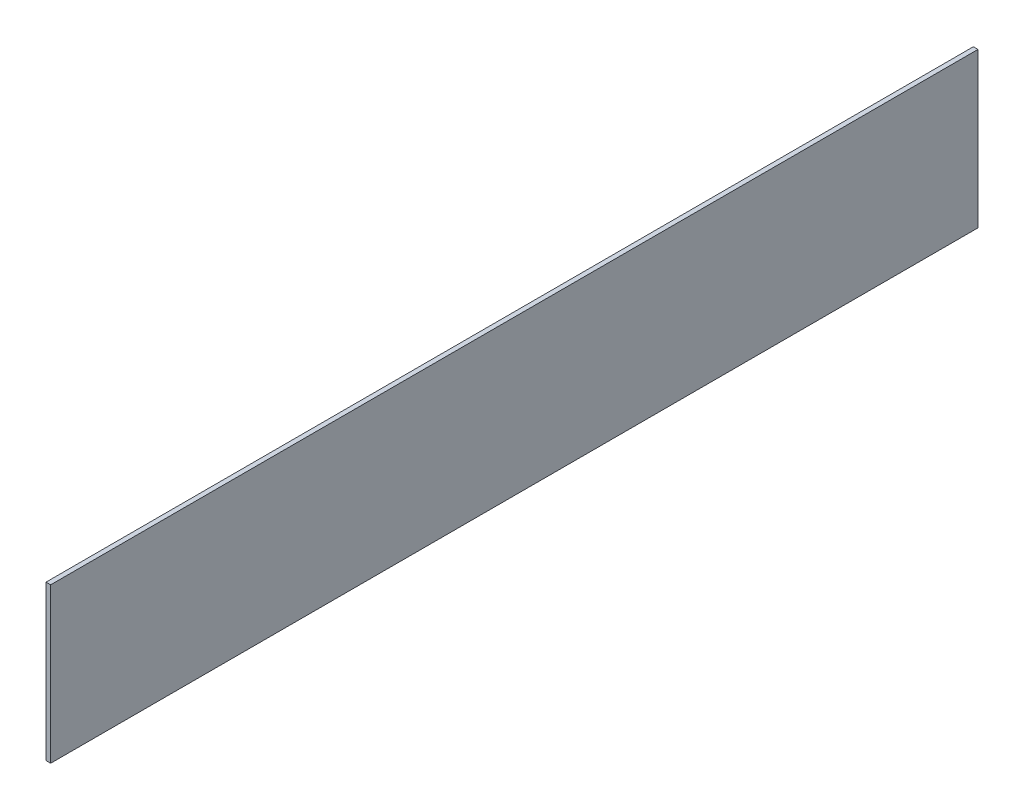
ISO-10303-21;
HEADER;
FILE_DESCRIPTION(('STEP AP214'),'2;1');
FILE_NAME('part.step','',(''),(''),'','','');
FILE_SCHEMA(('AUTOMOTIVE_DESIGN { 1 0 10303 214 1 1 1 1 }'));
ENDSEC;
DATA;
#1=APPLICATION_CONTEXT('core data for automotive mechanical design processes');
#2=APPLICATION_PROTOCOL_DEFINITION('international standard','automotive_design',2000,#1);
#3=PRODUCT_CONTEXT('',#1,'mechanical');
#4=PRODUCT('Part','Part','',(#3));
#5=PRODUCT_RELATED_PRODUCT_CATEGORY('part','',(#4));
#6=PRODUCT_DEFINITION_FORMATION('','',#4);
#7=PRODUCT_DEFINITION_CONTEXT('part definition',#1,'design');
#8=PRODUCT_DEFINITION('design','',#6,#7);
#9=PRODUCT_DEFINITION_SHAPE('','',#8);
#10=(LENGTH_UNIT() NAMED_UNIT(*) SI_UNIT(.MILLI.,.METRE.));
#11=(NAMED_UNIT(*) PLANE_ANGLE_UNIT() SI_UNIT($,.RADIAN.));
#12=(NAMED_UNIT(*) SI_UNIT($,.STERADIAN.) SOLID_ANGLE_UNIT());
#13=UNCERTAINTY_MEASURE_WITH_UNIT(LENGTH_MEASURE(1.E-05),#10,'distance_accuracy_value','');
#14=(GEOMETRIC_REPRESENTATION_CONTEXT(3) GLOBAL_UNCERTAINTY_ASSIGNED_CONTEXT((#13)) GLOBAL_UNIT_ASSIGNED_CONTEXT((#10,
#11,#12)) REPRESENTATION_CONTEXT('',''));
#15=CARTESIAN_POINT('',(0.,0.,0.));
#16=DIRECTION('',(0.,0.,1.));
#17=DIRECTION('',(1.,0.,0.));
#18=AXIS2_PLACEMENT_3D('',#15,#16,#17);
#19=CARTESIAN_POINT('',(1498.22600568237,4.55972065660504E-12,-23.5461781130641));
#20=DIRECTION('',(0.,0.,1.));
#21=DIRECTION('',(1.,0.,0.));
#22=AXIS2_PLACEMENT_3D('',#19,#20,#21);
#23=PLANE('',#22);
#24=DIRECTION('',(0.,1.,0.));
#25=VECTOR('',#24,1.);
#26=CARTESIAN_POINT('',(1495.22600568237,4.55972065660504E-12,-23.5461781130641));
#27=LINE('',#26,#25);
#28=CARTESIAN_POINT('',(1495.22600568237,4.55972065660504E-12,-23.5461781130641));
#29=VERTEX_POINT('',#28);
#30=CARTESIAN_POINT('',(1495.22600568237,100.,-23.5461781130641));
#31=VERTEX_POINT('',#30);
#32=EDGE_CURVE('E96',#29,#31,#27,.T.);
#33=ORIENTED_EDGE('',*,*,#32,.T.);
#34=DIRECTION('',(-1.,0.,0.));
#35=VECTOR('',#34,1.);
#36=CARTESIAN_POINT('',(1498.22600568237,100.,-23.5461781130641));
#37=LINE('',#36,#35);
#38=CARTESIAN_POINT('',(1498.22600568237,100.,-23.5461781130641));
#39=VERTEX_POINT('',#38);
#40=EDGE_CURVE('E11',#39,#31,#37,.T.);
#41=ORIENTED_EDGE('',*,*,#40,.F.);
#42=DIRECTION('',(0.,1.,0.));
#43=VECTOR('',#42,1.);
#44=CARTESIAN_POINT('',(1498.22600568237,4.55972065660504E-12,-23.5461781130641));
#45=LINE('',#44,#43);
#46=CARTESIAN_POINT('',(1498.22600568237,4.55972065660504E-12,-23.5461781130641));
#47=VERTEX_POINT('',#46);
#48=EDGE_CURVE('E84',#47,#39,#45,.T.);
#49=ORIENTED_EDGE('',*,*,#48,.F.);
#50=DIRECTION('',(-1.,0.,0.));
#51=VECTOR('',#50,1.);
#52=CARTESIAN_POINT('',(1498.22600568237,4.55972065660504E-12,-23.5461781130641));
#53=LINE('',#52,#51);
#54=EDGE_CURVE('E92',#47,#29,#53,.T.);
#55=ORIENTED_EDGE('',*,*,#54,.T.);
#56=EDGE_LOOP('',(#33,#41,#49,#55));
#57=FACE_BOUND('',#56,.T.);
#58=ADVANCED_FACE('F33',(#57),#23,.F.);
#59=CARTESIAN_POINT('',(1498.22600568237,100.,-23.5461781130641));
#60=DIRECTION('',(0.,-1.,0.));
#61=DIRECTION('',(0.,0.,-1.));
#62=AXIS2_PLACEMENT_3D('',#59,#60,#61);
#63=PLANE('',#62);
#64=DIRECTION('',(0.,0.,1.));
#65=VECTOR('',#64,1.);
#66=CARTESIAN_POINT('',(1495.22600568237,100.,-23.5461781130641));
#67=LINE('',#66,#65);
#68=CARTESIAN_POINT('',(1495.22600568237,99.9999999999999,576.453821886936));
#69=VERTEX_POINT('',#68);
#70=EDGE_CURVE('E88',#31,#69,#67,.T.);
#71=ORIENTED_EDGE('',*,*,#70,.T.);
#72=DIRECTION('',(-1.,0.,0.));
#73=VECTOR('',#72,1.);
#74=CARTESIAN_POINT('',(1498.22600568237,99.9999999999999,576.453821886936));
#75=LINE('',#74,#73);
#76=CARTESIAN_POINT('',(1498.22600568237,99.9999999999999,576.453821886936));
#77=VERTEX_POINT('',#76);
#78=EDGE_CURVE('E41',#77,#69,#75,.T.);
#79=ORIENTED_EDGE('',*,*,#78,.F.);
#80=DIRECTION('',(0.,0.,1.));
#81=VECTOR('',#80,1.);
#82=CARTESIAN_POINT('',(1498.22600568237,100.,-23.5461781130641));
#83=LINE('',#82,#81);
#84=EDGE_CURVE('E79',#39,#77,#83,.T.);
#85=ORIENTED_EDGE('',*,*,#84,.F.);
#86=ORIENTED_EDGE('',*,*,#40,.T.);
#87=EDGE_LOOP('',(#71,#79,#85,#86));
#88=FACE_BOUND('',#87,.T.);
#89=ADVANCED_FACE('F87',(#88),#63,.F.);
#90=CARTESIAN_POINT('',(1498.22600568237,0.,576.453821886936));
#91=DIRECTION('',(0.,0.,-1.));
#92=DIRECTION('',(-1.,0.,0.));
#93=AXIS2_PLACEMENT_3D('',#90,#91,#92);
#94=PLANE('',#93);
#95=DIRECTION('',(0.,-1.,0.));
#96=VECTOR('',#95,1.);
#97=CARTESIAN_POINT('',(1495.22600568237,0.,576.453821886936));
#98=LINE('',#97,#96);
#99=CARTESIAN_POINT('',(1495.22600568237,0.,576.453821886936));
#100=VERTEX_POINT('',#99);
#101=EDGE_CURVE('E66',#69,#100,#98,.T.);
#102=ORIENTED_EDGE('',*,*,#101,.T.);
#103=DIRECTION('',(-1.,0.,0.));
#104=VECTOR('',#103,1.);
#105=CARTESIAN_POINT('',(1498.22600568237,0.,576.453821886936));
#106=LINE('',#105,#104);
#107=CARTESIAN_POINT('',(1498.22600568237,0.,576.453821886936));
#108=VERTEX_POINT('',#107);
#109=EDGE_CURVE('E89',#108,#100,#106,.T.);
#110=ORIENTED_EDGE('',*,*,#109,.F.);
#111=DIRECTION('',(0.,-1.,0.));
#112=VECTOR('',#111,1.);
#113=CARTESIAN_POINT('',(1498.22600568237,0.,576.453821886936));
#114=LINE('',#113,#112);
#115=EDGE_CURVE('E82',#77,#108,#114,.T.);
#116=ORIENTED_EDGE('',*,*,#115,.F.);
#117=ORIENTED_EDGE('',*,*,#78,.T.);
#118=EDGE_LOOP('',(#102,#110,#116,#117));
#119=FACE_BOUND('',#118,.T.);
#120=ADVANCED_FACE('F90',(#119),#94,.F.);
#121=CARTESIAN_POINT('',(1498.22600568237,4.55972065660504E-12,-23.5461781130641));
#122=DIRECTION('',(0.,1.,0.));
#123=DIRECTION('',(0.,0.,1.));
#124=AXIS2_PLACEMENT_3D('',#121,#122,#123);
#125=PLANE('',#124);
#126=DIRECTION('',(0.,0.,-1.));
#127=VECTOR('',#126,1.);
#128=CARTESIAN_POINT('',(1495.22600568237,4.55972065660504E-12,-23.5461781130641));
#129=LINE('',#128,#127);
#130=EDGE_CURVE('E72',#100,#29,#129,.T.);
#131=ORIENTED_EDGE('',*,*,#130,.T.);
#132=ORIENTED_EDGE('',*,*,#54,.F.);
#133=DIRECTION('',(0.,0.,-1.));
#134=VECTOR('',#133,1.);
#135=CARTESIAN_POINT('',(1498.22600568237,4.55972065660504E-12,-23.5461781130641));
#136=LINE('',#135,#134);
#137=EDGE_CURVE('E49',#108,#47,#136,.T.);
#138=ORIENTED_EDGE('',*,*,#137,.F.);
#139=ORIENTED_EDGE('',*,*,#109,.T.);
#140=EDGE_LOOP('',(#131,#132,#138,#139));
#141=FACE_BOUND('',#140,.T.);
#142=ADVANCED_FACE('F103',(#141),#125,.F.);
#143=CARTESIAN_POINT('',(1498.22600568237,100.,-23.5461781130641));
#144=DIRECTION('',(1.,0.,0.));
#145=DIRECTION('',(0.,0.,-1.));
#146=AXIS2_PLACEMENT_3D('',#143,#144,#145);
#147=PLANE('',#146);
#148=ORIENTED_EDGE('',*,*,#48,.T.);
#149=ORIENTED_EDGE('',*,*,#84,.T.);
#150=ORIENTED_EDGE('',*,*,#115,.T.);
#151=ORIENTED_EDGE('',*,*,#137,.T.);
#152=EDGE_LOOP('',(#148,#149,#150,#151));
#153=FACE_BOUND('',#152,.T.);
#154=ADVANCED_FACE('F80',(#153),#147,.T.);
#155=CARTESIAN_POINT('',(1495.22600568237,100.,-23.5461781130641));
#156=DIRECTION('',(1.,0.,0.));
#157=DIRECTION('',(0.,0.,-1.));
#158=AXIS2_PLACEMENT_3D('',#155,#156,#157);
#159=PLANE('',#158);
#160=ORIENTED_EDGE('',*,*,#32,.F.);
#161=ORIENTED_EDGE('',*,*,#130,.F.);
#162=ORIENTED_EDGE('',*,*,#101,.F.);
#163=ORIENTED_EDGE('',*,*,#70,.F.);
#164=EDGE_LOOP('',(#160,#161,#162,#163));
#165=FACE_BOUND('',#164,.T.);
#166=ADVANCED_FACE('F106',(#165),#159,.F.);
#167=CLOSED_SHELL('',(#58,#89,#120,#142,#154,#166));
#168=MANIFOLD_SOLID_BREP('B2',#167);
#169=ADVANCED_BREP_SHAPE_REPRESENTATION('',(#18,#168),#14);
#170=SHAPE_DEFINITION_REPRESENTATION(#9,#169);
ENDSEC;
END-ISO-10303-21;
